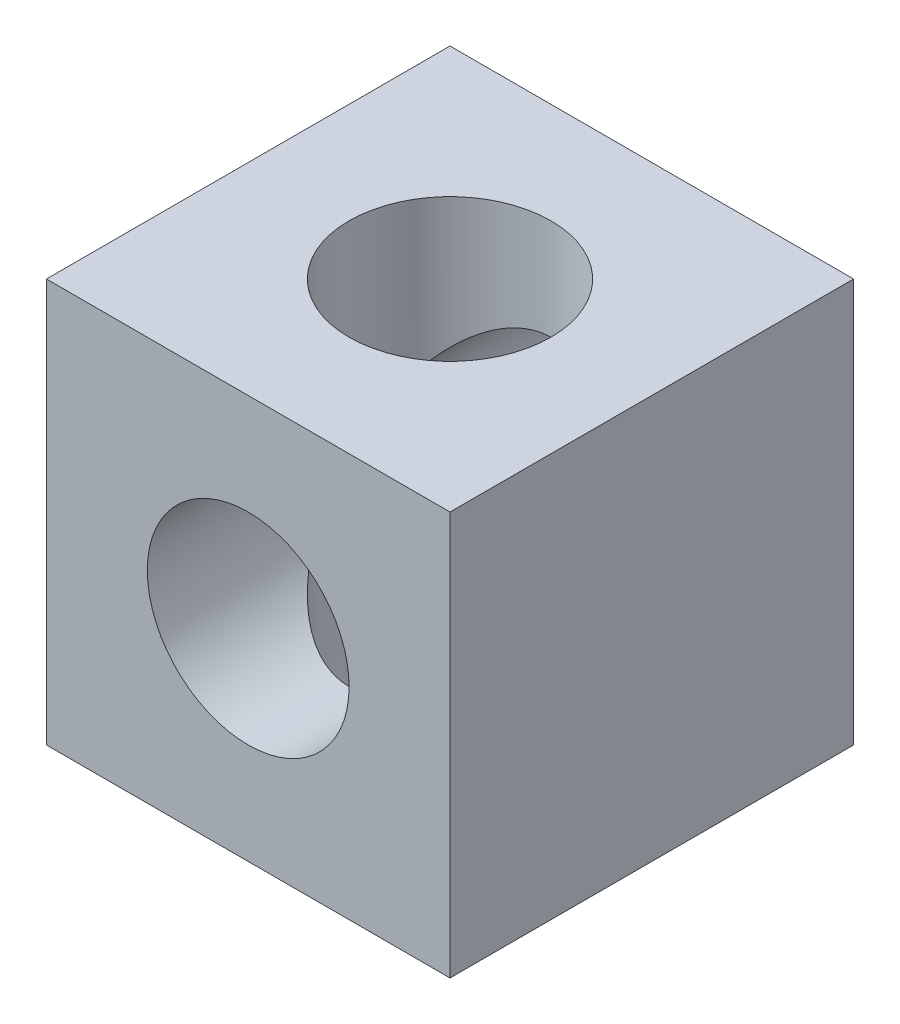
ISO-10303-21;
HEADER;
FILE_DESCRIPTION(('STEP AP214'),'2;1');
FILE_NAME('part.step','',(''),(''),'','','');
FILE_SCHEMA(('AUTOMOTIVE_DESIGN { 1 0 10303 214 1 1 1 1 }'));
ENDSEC;
DATA;
#1=APPLICATION_CONTEXT('core data for automotive mechanical design processes');
#2=APPLICATION_PROTOCOL_DEFINITION('international standard','automotive_design',2000,#1);
#3=PRODUCT_CONTEXT('',#1,'mechanical');
#4=PRODUCT('Part','Part','',(#3));
#5=PRODUCT_RELATED_PRODUCT_CATEGORY('part','',(#4));
#6=PRODUCT_DEFINITION_FORMATION('','',#4);
#7=PRODUCT_DEFINITION_CONTEXT('part definition',#1,'design');
#8=PRODUCT_DEFINITION('design','',#6,#7);
#9=PRODUCT_DEFINITION_SHAPE('','',#8);
#10=(LENGTH_UNIT() NAMED_UNIT(*) SI_UNIT(.MILLI.,.METRE.));
#11=(NAMED_UNIT(*) PLANE_ANGLE_UNIT() SI_UNIT($,.RADIAN.));
#12=(NAMED_UNIT(*) SI_UNIT($,.STERADIAN.) SOLID_ANGLE_UNIT());
#13=UNCERTAINTY_MEASURE_WITH_UNIT(LENGTH_MEASURE(1.E-05),#10,'distance_accuracy_value','');
#14=(GEOMETRIC_REPRESENTATION_CONTEXT(3) GLOBAL_UNCERTAINTY_ASSIGNED_CONTEXT((#13)) GLOBAL_UNIT_ASSIGNED_CONTEXT((#10,
#11,#12)) REPRESENTATION_CONTEXT('',''));
#15=CARTESIAN_POINT('',(0.,0.,0.));
#16=DIRECTION('',(0.,0.,1.));
#17=DIRECTION('',(1.,0.,0.));
#18=AXIS2_PLACEMENT_3D('',#15,#16,#17);
#19=CARTESIAN_POINT('',(-1.65145674912992E-12,-1.23165366794353E-13,10.0000000000072));
#20=DIRECTION('',(0.,0.,-1.00000000000001));
#21=DIRECTION('',(-1.00000000000002,0.,0.));
#22=AXIS2_PLACEMENT_3D('',#19,#20,#21);
#23=CYLINDRICAL_SURFACE('',#22,2.5);
#24=CARTESIAN_POINT('',(-7.49400541621981E-13,-2.23779328401008E-13,4.99999999999978));
#25=DIRECTION('',(0.,0.707106781186564,-0.707106781186548));
#26=DIRECTION('',(0.,-0.70710678118656,-0.707106781186551));
#27=AXIS2_PLACEMENT_3D('',#24,#25,#26);
#28=ELLIPSE('',#27,3.53553390593274,2.5);
#29=CARTESIAN_POINT('',(2.49999999999879,0.,5.00000000000733));
#30=VERTEX_POINT('',#29);
#31=CARTESIAN_POINT('',(-2.50000000000203,7.8756445809347E-13,4.99999999999978));
#32=VERTEX_POINT('',#31);
#33=EDGE_CURVE('E11',#30,#32,#28,.F.);
#34=ORIENTED_EDGE('',*,*,#33,.F.);
#35=CARTESIAN_POINT('',(-7.49400541621981E-13,-2.23779328401008E-13,4.99999999999978));
#36=DIRECTION('',(0.,-0.70710678118656,-0.707106781186551));
#37=DIRECTION('',(0.,0.707106781186564,-0.707106781186548));
#38=AXIS2_PLACEMENT_3D('',#35,#36,#37);
#39=ELLIPSE('',#38,3.53553390593274,2.5);
#40=EDGE_CURVE('E30',#32,#30,#39,.F.);
#41=ORIENTED_EDGE('',*,*,#40,.F.);
#42=EDGE_LOOP('',(#34,#41));
#43=FACE_BOUND('',#42,.T.);
#44=CARTESIAN_POINT('',(-1.65145674912992E-12,-1.23165366794353E-13,10.0000000000072));
#45=DIRECTION('',(0.,0.,1.00000000000001));
#46=DIRECTION('',(1.00000000000002,0.,0.));
#47=AXIS2_PLACEMENT_3D('',#44,#45,#46);
#48=CIRCLE('',#47,2.5);
#49=CARTESIAN_POINT('',(2.49999999999839,-1.23174040411733E-13,10.0000000000072));
#50=VERTEX_POINT('',#49);
#51=EDGE_CURVE('E106',#50,#50,#48,.T.);
#52=ORIENTED_EDGE('',*,*,#51,.T.);
#53=EDGE_LOOP('',(#52));
#54=FACE_BOUND('',#53,.T.);
#55=ADVANCED_FACE('F16',(#43,#54),#23,.F.);
#56=CARTESIAN_POINT('',(-5.00000000000116,-5.,9.99999999999934));
#57=DIRECTION('',(0.,0.,-1.00000000000001));
#58=DIRECTION('',(-1.00000000000002,0.,0.));
#59=AXIS2_PLACEMENT_3D('',#56,#57,#58);
#60=PLANE('',#59);
#61=DIRECTION('',(0.,-1.00000000000002,0.));
#62=VECTOR('',#61,1.);
#63=CARTESIAN_POINT('',(-5.00000000000116,-5.,9.99999999999934));
#64=LINE('',#63,#62);
#65=CARTESIAN_POINT('',(-5.00000000000114,4.99999999999956,9.99999999999956));
#66=VERTEX_POINT('',#65);
#67=CARTESIAN_POINT('',(-5.00000000000116,-5.,9.99999999999934));
#68=VERTEX_POINT('',#67);
#69=EDGE_CURVE('E95',#66,#68,#64,.T.);
#70=ORIENTED_EDGE('',*,*,#69,.T.);
#71=DIRECTION('',(1.00000000000002,0.,0.));
#72=VECTOR('',#71,1.);
#73=CARTESIAN_POINT('',(-5.00000000000116,-5.,9.99999999999934));
#74=LINE('',#73,#72);
#75=CARTESIAN_POINT('',(4.99999999999787,-5.00000000000054,10.0000000000053));
#76=VERTEX_POINT('',#75);
#77=EDGE_CURVE('E93',#68,#76,#74,.T.);
#78=ORIENTED_EDGE('',*,*,#77,.T.);
#79=DIRECTION('',(0.,1.00000000000002,0.));
#80=VECTOR('',#79,1.);
#81=CARTESIAN_POINT('',(4.99999999999787,-5.00000000000054,10.0000000000053));
#82=LINE('',#81,#80);
#83=CARTESIAN_POINT('',(4.99999999999855,4.99999999999949,9.99999999999956));
#84=VERTEX_POINT('',#83);
#85=EDGE_CURVE('E91',#76,#84,#82,.T.);
#86=ORIENTED_EDGE('',*,*,#85,.T.);
#87=DIRECTION('',(-1.00000000000002,0.,0.));
#88=VECTOR('',#87,1.);
#89=CARTESIAN_POINT('',(-5.00000000000114,4.99999999999956,9.99999999999956));
#90=LINE('',#89,#88);
#91=EDGE_CURVE('E38',#84,#66,#90,.T.);
#92=ORIENTED_EDGE('',*,*,#91,.T.);
#93=EDGE_LOOP('',(#70,#78,#86,#92));
#94=FACE_BOUND('',#93,.T.);
#95=ORIENTED_EDGE('',*,*,#51,.F.);
#96=EDGE_LOOP('',(#95));
#97=FACE_BOUND('',#96,.T.);
#98=ADVANCED_FACE('F138',(#94,#97),#60,.F.);
#99=CARTESIAN_POINT('',(-5.00000000000156,-5.00000000000069,6.99440505513849E-12));
#100=DIRECTION('',(0.,0.,-1.00000000000001));
#101=DIRECTION('',(-1.00000000000002,0.,0.));
#102=AXIS2_PLACEMENT_3D('',#99,#100,#101);
#103=PLANE('',#102);
#104=DIRECTION('',(0.,-1.00000000000002,0.));
#105=VECTOR('',#104,1.);
#106=CARTESIAN_POINT('',(-5.00000000000156,-5.00000000000069,6.99440505513849E-12));
#107=LINE('',#106,#105);
#108=CARTESIAN_POINT('',(-5.00000000000107,4.99999999999987,-2.44249065417534E-12));
#109=VERTEX_POINT('',#108);
#110=CARTESIAN_POINT('',(-5.00000000000156,-5.00000000000069,6.99440505513849E-12));
#111=VERTEX_POINT('',#110);
#112=EDGE_CURVE('E103',#109,#111,#107,.T.);
#113=ORIENTED_EDGE('',*,*,#112,.F.);
#114=DIRECTION('',(-1.00000000000002,0.,0.));
#115=VECTOR('',#114,1.);
#116=CARTESIAN_POINT('',(-5.00000000000107,4.99999999999987,-2.44249065417534E-12));
#117=LINE('',#116,#115);
#118=CARTESIAN_POINT('',(4.99999999999821,5.00000000000047,-4.44089209850063E-13));
#119=VERTEX_POINT('',#118);
#120=EDGE_CURVE('E97',#119,#109,#117,.T.);
#121=ORIENTED_EDGE('',*,*,#120,.F.);
#122=DIRECTION('',(0.,1.00000000000002,0.));
#123=VECTOR('',#122,1.);
#124=CARTESIAN_POINT('',(4.99999999999769,-5.00000000000128,7.54951656745106E-12));
#125=LINE('',#124,#123);
#126=CARTESIAN_POINT('',(4.99999999999769,-5.00000000000128,7.54951656745106E-12));
#127=VERTEX_POINT('',#126);
#128=EDGE_CURVE('E99',#127,#119,#125,.T.);
#129=ORIENTED_EDGE('',*,*,#128,.F.);
#130=DIRECTION('',(1.00000000000002,0.,0.));
#131=VECTOR('',#130,1.);
#132=CARTESIAN_POINT('',(-5.00000000000156,-5.00000000000069,6.99440505513849E-12));
#133=LINE('',#132,#131);
#134=EDGE_CURVE('E101',#111,#127,#133,.T.);
#135=ORIENTED_EDGE('',*,*,#134,.F.);
#136=EDGE_LOOP('',(#113,#121,#129,#135));
#137=FACE_BOUND('',#136,.T.);
#138=CARTESIAN_POINT('',(-1.23512311489549E-12,-1.07552855510562E-13,-2.22044604925031E-13));
#139=DIRECTION('',(0.,0.,1.00000000000001));
#140=DIRECTION('',(1.00000000000002,0.,0.));
#141=AXIS2_PLACEMENT_3D('',#138,#139,#140);
#142=CIRCLE('',#141,2.5);
#143=CARTESIAN_POINT('',(2.49999999999881,-1.07561529127942E-13,-2.02754479872169E-13));
#144=VERTEX_POINT('',#143);
#145=EDGE_CURVE('E109',#144,#144,#142,.T.);
#146=ORIENTED_EDGE('',*,*,#145,.T.);
#147=EDGE_LOOP('',(#146));
#148=FACE_BOUND('',#147,.T.);
#149=ADVANCED_FACE('F132',(#137,#148),#103,.T.);
#150=CARTESIAN_POINT('',(-5.00000000000116,-5.,9.99999999999934));
#151=DIRECTION('',(1.00000000000002,0.,0.));
#152=DIRECTION('',(0.,0.,-1.00000000000001));
#153=AXIS2_PLACEMENT_3D('',#150,#151,#152);
#154=PLANE('',#153);
#155=ORIENTED_EDGE('',*,*,#112,.T.);
#156=DIRECTION('',(0.,0.,-1.00000000000001));
#157=VECTOR('',#156,1.);
#158=CARTESIAN_POINT('',(-5.00000000000116,-5.,9.99999999999934));
#159=LINE('',#158,#157);
#160=EDGE_CURVE('E73',#68,#111,#159,.T.);
#161=ORIENTED_EDGE('',*,*,#160,.F.);
#162=ORIENTED_EDGE('',*,*,#69,.F.);
#163=DIRECTION('',(0.,0.,-1.00000000000001));
#164=VECTOR('',#163,1.);
#165=CARTESIAN_POINT('',(-5.00000000000114,4.99999999999956,9.99999999999956));
#166=LINE('',#165,#164);
#167=EDGE_CURVE('E87',#66,#109,#166,.T.);
#168=ORIENTED_EDGE('',*,*,#167,.T.);
#169=EDGE_LOOP('',(#155,#161,#162,#168));
#170=FACE_BOUND('',#169,.T.);
#171=ADVANCED_FACE('F18',(#170),#154,.F.);
#172=CARTESIAN_POINT('',(-5.00000000000116,-5.,9.99999999999934));
#173=DIRECTION('',(0.,1.00000000000002,0.));
#174=DIRECTION('',(0.,0.,1.00000000000001));
#175=AXIS2_PLACEMENT_3D('',#172,#173,#174);
#176=PLANE('',#175);
#177=CARTESIAN_POINT('',(-1.11022302462516E-12,-5.00000000000004,5.000000000005));
#178=DIRECTION('',(0.,1.00000000000002,0.));
#179=DIRECTION('',(0.,0.,1.00000000000001));
#180=AXIS2_PLACEMENT_3D('',#177,#178,#179);
#181=CIRCLE('',#180,2.5);
#182=CARTESIAN_POINT('',(-1.0753203882885E-12,-5.00000000000004,7.50000000000503));
#183=VERTEX_POINT('',#182);
#184=EDGE_CURVE('E112',#183,#183,#181,.T.);
#185=ORIENTED_EDGE('',*,*,#184,.T.);
#186=EDGE_LOOP('',(#185));
#187=FACE_BOUND('',#186,.T.);
#188=ORIENTED_EDGE('',*,*,#134,.T.);
#189=DIRECTION('',(0.,0.,-1.00000000000001));
#190=VECTOR('',#189,1.);
#191=CARTESIAN_POINT('',(4.99999999999787,-5.00000000000054,10.0000000000053));
#192=LINE('',#191,#190);
#193=EDGE_CURVE('E81',#76,#127,#192,.T.);
#194=ORIENTED_EDGE('',*,*,#193,.F.);
#195=ORIENTED_EDGE('',*,*,#77,.F.);
#196=ORIENTED_EDGE('',*,*,#160,.T.);
#197=EDGE_LOOP('',(#188,#194,#195,#196));
#198=FACE_BOUND('',#197,.T.);
#199=ADVANCED_FACE('F136',(#187,#198),#176,.F.);
#200=CARTESIAN_POINT('',(4.99999999999787,-5.00000000000054,10.0000000000053));
#201=DIRECTION('',(-1.00000000000002,0.,0.));
#202=DIRECTION('',(0.,0.,1.00000000000001));
#203=AXIS2_PLACEMENT_3D('',#200,#201,#202);
#204=PLANE('',#203);
#205=ORIENTED_EDGE('',*,*,#128,.T.);
#206=DIRECTION('',(0.,0.,-1.00000000000001));
#207=VECTOR('',#206,1.);
#208=CARTESIAN_POINT('',(4.99999999999855,4.99999999999949,9.99999999999956));
#209=LINE('',#208,#207);
#210=EDGE_CURVE('E84',#84,#119,#209,.T.);
#211=ORIENTED_EDGE('',*,*,#210,.F.);
#212=ORIENTED_EDGE('',*,*,#85,.F.);
#213=ORIENTED_EDGE('',*,*,#193,.T.);
#214=EDGE_LOOP('',(#205,#211,#212,#213));
#215=FACE_BOUND('',#214,.T.);
#216=ADVANCED_FACE('F122',(#215),#204,.F.);
#217=CARTESIAN_POINT('',(-5.00000000000114,4.99999999999956,9.99999999999956));
#218=DIRECTION('',(0.,-1.00000000000002,0.));
#219=DIRECTION('',(1.00000000000002,0.,0.));
#220=AXIS2_PLACEMENT_3D('',#217,#218,#219);
#221=PLANE('',#220);
#222=CARTESIAN_POINT('',(-1.346145417358E-12,4.99999999999947,5.00000000000722));
#223=DIRECTION('',(0.,1.00000000000002,0.));
#224=DIRECTION('',(0.,0.,1.00000000000001));
#225=AXIS2_PLACEMENT_3D('',#222,#223,#224);
#226=CIRCLE('',#225,2.5);
#227=CARTESIAN_POINT('',(-1.31124278102135E-12,4.99999999999947,7.50000000000725));
#228=VERTEX_POINT('',#227);
#229=EDGE_CURVE('E115',#228,#228,#226,.T.);
#230=ORIENTED_EDGE('',*,*,#229,.F.);
#231=EDGE_LOOP('',(#230));
#232=FACE_BOUND('',#231,.T.);
#233=ORIENTED_EDGE('',*,*,#120,.T.);
#234=ORIENTED_EDGE('',*,*,#167,.F.);
#235=ORIENTED_EDGE('',*,*,#91,.F.);
#236=ORIENTED_EDGE('',*,*,#210,.T.);
#237=EDGE_LOOP('',(#233,#234,#235,#236));
#238=FACE_BOUND('',#237,.T.);
#239=ADVANCED_FACE('F119',(#232,#238),#221,.F.);
#240=CARTESIAN_POINT('',(-7.49400541621981E-13,-2.23779328401008E-13,4.99999999999978));
#241=DIRECTION('',(0.,0.707106781186564,-0.707106781186548));
#242=DIRECTION('',(0.,-0.70710678118656,-0.707106781186551));
#243=AXIS2_PLACEMENT_3D('',#240,#241,#242);
#244=ELLIPSE('',#243,3.53553390593274,2.5);
#245=EDGE_CURVE('E24',#30,#32,#244,.T.);
#246=ORIENTED_EDGE('',*,*,#245,.F.);
#247=CARTESIAN_POINT('',(-7.49400541621981E-13,-2.23779328401008E-13,4.99999999999978));
#248=DIRECTION('',(0.,-0.70710678118656,-0.707106781186551));
#249=DIRECTION('',(0.,0.707106781186564,-0.707106781186548));
#250=AXIS2_PLACEMENT_3D('',#247,#248,#249);
#251=ELLIPSE('',#250,3.53553390593274,2.5);
#252=EDGE_CURVE('E64',#32,#30,#251,.T.);
#253=ORIENTED_EDGE('',*,*,#252,.F.);
#254=EDGE_LOOP('',(#246,#253));
#255=FACE_BOUND('',#254,.T.);
#256=ORIENTED_EDGE('',*,*,#145,.F.);
#257=EDGE_LOOP('',(#256));
#258=FACE_BOUND('',#257,.T.);
#259=ADVANCED_FACE('F76',(#255,#258),#23,.F.);
#260=CARTESIAN_POINT('',(-1.11022302462516E-12,-5.00000000000004,5.000000000005));
#261=DIRECTION('',(0.,1.00000000000002,0.));
#262=DIRECTION('',(0.,0.,1.00000000000001));
#263=AXIS2_PLACEMENT_3D('',#260,#261,#262);
#264=CYLINDRICAL_SURFACE('',#263,2.5);
#265=ORIENTED_EDGE('',*,*,#245,.T.);
#266=ORIENTED_EDGE('',*,*,#40,.T.);
#267=EDGE_LOOP('',(#265,#266));
#268=FACE_BOUND('',#267,.T.);
#269=ORIENTED_EDGE('',*,*,#184,.F.);
#270=EDGE_LOOP('',(#269));
#271=FACE_BOUND('',#270,.T.);
#272=ADVANCED_FACE('F71',(#268,#271),#264,.F.);
#273=ORIENTED_EDGE('',*,*,#33,.T.);
#274=ORIENTED_EDGE('',*,*,#252,.T.);
#275=EDGE_LOOP('',(#273,#274));
#276=FACE_BOUND('',#275,.T.);
#277=ORIENTED_EDGE('',*,*,#229,.T.);
#278=EDGE_LOOP('',(#277));
#279=FACE_BOUND('',#278,.T.);
#280=ADVANCED_FACE('F65',(#276,#279),#264,.F.);
#281=CLOSED_SHELL('',(#55,#98,#149,#171,#199,#216,#239,#259,#272,#280));
#282=MANIFOLD_SOLID_BREP('B1',#281);
#283=ADVANCED_BREP_SHAPE_REPRESENTATION('',(#18,#282),#14);
#284=SHAPE_DEFINITION_REPRESENTATION(#9,#283);
ENDSEC;
END-ISO-10303-21;
